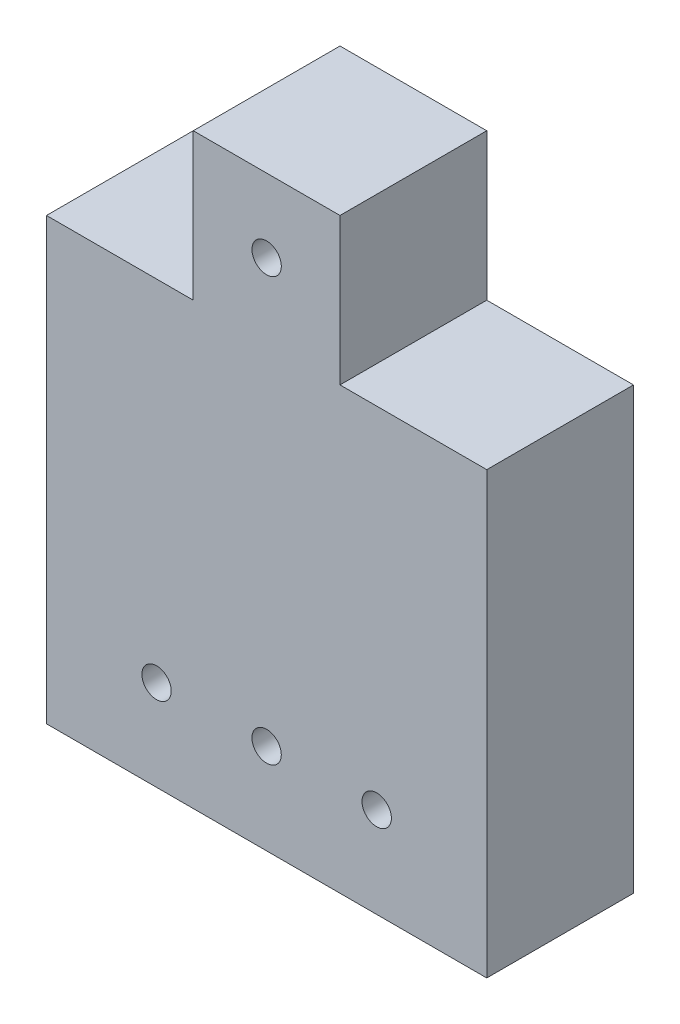
ISO-10303-21;
HEADER;
FILE_DESCRIPTION(('STEP AP214'),'2;1');
FILE_NAME('part.step','',(''),(''),'','','');
FILE_SCHEMA(('AUTOMOTIVE_DESIGN { 1 0 10303 214 1 1 1 1 }'));
ENDSEC;
DATA;
#1=APPLICATION_CONTEXT('core data for automotive mechanical design processes');
#2=APPLICATION_PROTOCOL_DEFINITION('international standard','automotive_design',2000,#1);
#3=PRODUCT_CONTEXT('',#1,'mechanical');
#4=PRODUCT('Part','Part','',(#3));
#5=PRODUCT_RELATED_PRODUCT_CATEGORY('part','',(#4));
#6=PRODUCT_DEFINITION_FORMATION('','',#4);
#7=PRODUCT_DEFINITION_CONTEXT('part definition',#1,'design');
#8=PRODUCT_DEFINITION('design','',#6,#7);
#9=PRODUCT_DEFINITION_SHAPE('','',#8);
#10=(LENGTH_UNIT() NAMED_UNIT(*) SI_UNIT(.MILLI.,.METRE.));
#11=(NAMED_UNIT(*) PLANE_ANGLE_UNIT() SI_UNIT($,.RADIAN.));
#12=(NAMED_UNIT(*) SI_UNIT($,.STERADIAN.) SOLID_ANGLE_UNIT());
#13=UNCERTAINTY_MEASURE_WITH_UNIT(LENGTH_MEASURE(1.E-05),#10,'distance_accuracy_value','');
#14=(GEOMETRIC_REPRESENTATION_CONTEXT(3) GLOBAL_UNCERTAINTY_ASSIGNED_CONTEXT((#13)) GLOBAL_UNIT_ASSIGNED_CONTEXT((#10,
#11,#12)) REPRESENTATION_CONTEXT('',''));
#15=CARTESIAN_POINT('',(0.,0.,0.));
#16=DIRECTION('',(0.,0.,1.));
#17=DIRECTION('',(1.,0.,0.));
#18=AXIS2_PLACEMENT_3D('',#15,#16,#17);
#19=CARTESIAN_POINT('',(0.,0.,6.35));
#20=DIRECTION('',(1.,0.,0.));
#21=DIRECTION('',(0.,1.,0.));
#22=AXIS2_PLACEMENT_3D('',#19,#20,#21);
#23=PLANE('',#22);
#24=DIRECTION('',(0.,-1.,0.));
#25=VECTOR('',#24,1.);
#26=CARTESIAN_POINT('',(0.,0.,6.35));
#27=LINE('',#26,#25);
#28=CARTESIAN_POINT('',(0.,19.05,6.35));
#29=VERTEX_POINT('',#28);
#30=CARTESIAN_POINT('',(0.,0.,6.35));
#31=VERTEX_POINT('',#30);
#32=EDGE_CURVE('E126',#29,#31,#27,.T.);
#33=ORIENTED_EDGE('',*,*,#32,.F.);
#34=DIRECTION('',(0.,0.,-1.));
#35=VECTOR('',#34,1.);
#36=CARTESIAN_POINT('',(0.,19.05,6.35));
#37=LINE('',#36,#35);
#38=CARTESIAN_POINT('',(0.,19.05,0.));
#39=VERTEX_POINT('',#38);
#40=EDGE_CURVE('E133',#29,#39,#37,.T.);
#41=ORIENTED_EDGE('',*,*,#40,.T.);
#42=DIRECTION('',(0.,-1.,0.));
#43=VECTOR('',#42,1.);
#44=CARTESIAN_POINT('',(0.,0.,0.));
#45=LINE('',#44,#43);
#46=CARTESIAN_POINT('',(0.,0.,0.));
#47=VERTEX_POINT('',#46);
#48=EDGE_CURVE('E130',#39,#47,#45,.T.);
#49=ORIENTED_EDGE('',*,*,#48,.T.);
#50=DIRECTION('',(0.,0.,-1.));
#51=VECTOR('',#50,1.);
#52=CARTESIAN_POINT('',(0.,0.,6.35));
#53=LINE('',#52,#51);
#54=EDGE_CURVE('E11',#31,#47,#53,.T.);
#55=ORIENTED_EDGE('',*,*,#54,.F.);
#56=EDGE_LOOP('',(#33,#41,#49,#55));
#57=FACE_BOUND('',#56,.T.);
#58=ADVANCED_FACE('F35',(#57),#23,.F.);
#59=CARTESIAN_POINT('',(0.,0.,6.35));
#60=DIRECTION('',(0.,1.,0.));
#61=DIRECTION('',(0.,0.,1.));
#62=AXIS2_PLACEMENT_3D('',#59,#60,#61);
#63=PLANE('',#62);
#64=DIRECTION('',(1.,0.,0.));
#65=VECTOR('',#64,1.);
#66=CARTESIAN_POINT('',(0.,0.,0.));
#67=LINE('',#66,#65);
#68=CARTESIAN_POINT('',(19.05,0.,0.));
#69=VERTEX_POINT('',#68);
#70=EDGE_CURVE('E132',#47,#69,#67,.T.);
#71=ORIENTED_EDGE('',*,*,#70,.T.);
#72=DIRECTION('',(0.,0.,-1.));
#73=VECTOR('',#72,1.);
#74=CARTESIAN_POINT('',(19.05,0.,6.35));
#75=LINE('',#74,#73);
#76=CARTESIAN_POINT('',(19.05,0.,6.35));
#77=VERTEX_POINT('',#76);
#78=EDGE_CURVE('E42',#77,#69,#75,.T.);
#79=ORIENTED_EDGE('',*,*,#78,.F.);
#80=DIRECTION('',(1.,0.,0.));
#81=VECTOR('',#80,1.);
#82=CARTESIAN_POINT('',(0.,0.,6.35));
#83=LINE('',#82,#81);
#84=EDGE_CURVE('E121',#31,#77,#83,.T.);
#85=ORIENTED_EDGE('',*,*,#84,.F.);
#86=ORIENTED_EDGE('',*,*,#54,.T.);
#87=EDGE_LOOP('',(#71,#79,#85,#86));
#88=FACE_BOUND('',#87,.T.);
#89=ADVANCED_FACE('F174',(#88),#63,.F.);
#90=CARTESIAN_POINT('',(19.05,0.,6.35));
#91=DIRECTION('',(-1.,0.,0.));
#92=DIRECTION('',(0.,-1.,0.));
#93=AXIS2_PLACEMENT_3D('',#90,#91,#92);
#94=PLANE('',#93);
#95=DIRECTION('',(0.,1.,0.));
#96=VECTOR('',#95,1.);
#97=CARTESIAN_POINT('',(19.05,0.,0.));
#98=LINE('',#97,#96);
#99=CARTESIAN_POINT('',(19.05,19.05,0.));
#100=VERTEX_POINT('',#99);
#101=EDGE_CURVE('E117',#69,#100,#98,.T.);
#102=ORIENTED_EDGE('',*,*,#101,.T.);
#103=DIRECTION('',(0.,0.,-1.));
#104=VECTOR('',#103,1.);
#105=CARTESIAN_POINT('',(19.05,19.05,6.35));
#106=LINE('',#105,#104);
#107=CARTESIAN_POINT('',(19.05,19.05,6.35));
#108=VERTEX_POINT('',#107);
#109=EDGE_CURVE('E49',#108,#100,#106,.T.);
#110=ORIENTED_EDGE('',*,*,#109,.F.);
#111=DIRECTION('',(0.,1.,0.));
#112=VECTOR('',#111,1.);
#113=CARTESIAN_POINT('',(19.05,0.,6.35));
#114=LINE('',#113,#112);
#115=EDGE_CURVE('E115',#77,#108,#114,.T.);
#116=ORIENTED_EDGE('',*,*,#115,.F.);
#117=ORIENTED_EDGE('',*,*,#78,.T.);
#118=EDGE_LOOP('',(#102,#110,#116,#117));
#119=FACE_BOUND('',#118,.T.);
#120=ADVANCED_FACE('F113',(#119),#94,.F.);
#121=CARTESIAN_POINT('',(0.,25.4,6.35));
#122=DIRECTION('',(0.,-1.,0.));
#123=DIRECTION('',(0.,0.,-1.));
#124=AXIS2_PLACEMENT_3D('',#121,#122,#123);
#125=PLANE('',#124);
#126=DIRECTION('',(-1.,0.,0.));
#127=VECTOR('',#126,1.);
#128=CARTESIAN_POINT('',(0.,25.4,6.35));
#129=LINE('',#128,#127);
#130=CARTESIAN_POINT('',(12.7,25.4,6.35));
#131=VERTEX_POINT('',#130);
#132=CARTESIAN_POINT('',(6.35,25.4,6.35));
#133=VERTEX_POINT('',#132);
#134=EDGE_CURVE('E123',#131,#133,#129,.T.);
#135=ORIENTED_EDGE('',*,*,#134,.F.);
#136=DIRECTION('',(0.,0.,-1.));
#137=VECTOR('',#136,1.);
#138=CARTESIAN_POINT('',(12.7,25.4,6.35));
#139=LINE('',#138,#137);
#140=CARTESIAN_POINT('',(12.7,25.4,0.));
#141=VERTEX_POINT('',#140);
#142=EDGE_CURVE('E151',#131,#141,#139,.T.);
#143=ORIENTED_EDGE('',*,*,#142,.T.);
#144=DIRECTION('',(-1.,0.,0.));
#145=VECTOR('',#144,1.);
#146=CARTESIAN_POINT('',(0.,25.4,0.));
#147=LINE('',#146,#145);
#148=CARTESIAN_POINT('',(6.35,25.4,0.));
#149=VERTEX_POINT('',#148);
#150=EDGE_CURVE('E57',#141,#149,#147,.T.);
#151=ORIENTED_EDGE('',*,*,#150,.T.);
#152=DIRECTION('',(0.,0.,-1.));
#153=VECTOR('',#152,1.);
#154=CARTESIAN_POINT('',(6.35,25.4,6.35));
#155=LINE('',#154,#153);
#156=EDGE_CURVE('E162',#133,#149,#155,.T.);
#157=ORIENTED_EDGE('',*,*,#156,.F.);
#158=EDGE_LOOP('',(#135,#143,#151,#157));
#159=FACE_BOUND('',#158,.T.);
#160=ADVANCED_FACE('F183',(#159),#125,.F.);
#161=CARTESIAN_POINT('',(0.,0.,6.35));
#162=DIRECTION('',(0.,0.,-1.));
#163=DIRECTION('',(-1.,0.,0.));
#164=AXIS2_PLACEMENT_3D('',#161,#162,#163);
#165=PLANE('',#164);
#166=CARTESIAN_POINT('',(4.7625,3.92205002782475,6.35));
#167=DIRECTION('',(0.,0.,1.));
#168=DIRECTION('',(1.,0.,0.));
#169=AXIS2_PLACEMENT_3D('',#166,#167,#168);
#170=CIRCLE('',#169,0.635000000000001);
#171=CARTESIAN_POINT('',(5.3975,3.92205002782475,6.35));
#172=VERTEX_POINT('',#171);
#173=EDGE_CURVE('E299',#172,#172,#170,.T.);
#174=ORIENTED_EDGE('',*,*,#173,.F.);
#175=EDGE_LOOP('',(#174));
#176=FACE_BOUND('',#175,.T.);
#177=CARTESIAN_POINT('',(9.525,3.92205002782475,6.35));
#178=DIRECTION('',(0.,0.,1.));
#179=DIRECTION('',(1.,0.,0.));
#180=AXIS2_PLACEMENT_3D('',#177,#178,#179);
#181=CIRCLE('',#180,0.635000000000001);
#182=CARTESIAN_POINT('',(10.16,3.92205002782475,6.35));
#183=VERTEX_POINT('',#182);
#184=EDGE_CURVE('E301',#183,#183,#181,.T.);
#185=ORIENTED_EDGE('',*,*,#184,.F.);
#186=EDGE_LOOP('',(#185));
#187=FACE_BOUND('',#186,.T.);
#188=CARTESIAN_POINT('',(14.2875,3.92205002782475,6.35));
#189=DIRECTION('',(0.,0.,1.));
#190=DIRECTION('',(1.,0.,0.));
#191=AXIS2_PLACEMENT_3D('',#188,#189,#190);
#192=CIRCLE('',#191,0.634999999999999);
#193=CARTESIAN_POINT('',(14.9225,3.92205002782475,6.35));
#194=VERTEX_POINT('',#193);
#195=EDGE_CURVE('E307',#194,#194,#192,.T.);
#196=ORIENTED_EDGE('',*,*,#195,.F.);
#197=EDGE_LOOP('',(#196));
#198=FACE_BOUND('',#197,.T.);
#199=CARTESIAN_POINT('',(9.52500000000001,22.225,6.35));
#200=DIRECTION('',(0.,0.,-1.));
#201=DIRECTION('',(-1.,0.,0.));
#202=AXIS2_PLACEMENT_3D('',#199,#200,#201);
#203=CIRCLE('',#202,0.635);
#204=CARTESIAN_POINT('',(8.89000000000001,22.225,6.35));
#205=VERTEX_POINT('',#204);
#206=EDGE_CURVE('E143',#205,#205,#203,.T.);
#207=ORIENTED_EDGE('',*,*,#206,.T.);
#208=EDGE_LOOP('',(#207));
#209=FACE_BOUND('',#208,.T.);
#210=DIRECTION('',(-1.,0.,0.));
#211=VECTOR('',#210,1.);
#212=CARTESIAN_POINT('',(19.05,19.05,6.35));
#213=LINE('',#212,#211);
#214=CARTESIAN_POINT('',(12.7,19.05,6.35));
#215=VERTEX_POINT('',#214);
#216=EDGE_CURVE('E100',#108,#215,#213,.T.);
#217=ORIENTED_EDGE('',*,*,#216,.T.);
#218=DIRECTION('',(0.,1.,0.));
#219=VECTOR('',#218,1.);
#220=CARTESIAN_POINT('',(12.7,25.4,6.35));
#221=LINE('',#220,#219);
#222=EDGE_CURVE('E107',#215,#131,#221,.T.);
#223=ORIENTED_EDGE('',*,*,#222,.T.);
#224=ORIENTED_EDGE('',*,*,#134,.T.);
#225=DIRECTION('',(0.,-1.,0.));
#226=VECTOR('',#225,1.);
#227=CARTESIAN_POINT('',(6.35,25.4,6.35));
#228=LINE('',#227,#226);
#229=CARTESIAN_POINT('',(6.35,19.05,6.35));
#230=VERTEX_POINT('',#229);
#231=EDGE_CURVE('E155',#133,#230,#228,.T.);
#232=ORIENTED_EDGE('',*,*,#231,.T.);
#233=DIRECTION('',(-1.,0.,0.));
#234=VECTOR('',#233,1.);
#235=CARTESIAN_POINT('',(0.,19.05,6.35));
#236=LINE('',#235,#234);
#237=EDGE_CURVE('E158',#230,#29,#236,.T.);
#238=ORIENTED_EDGE('',*,*,#237,.T.);
#239=ORIENTED_EDGE('',*,*,#32,.T.);
#240=ORIENTED_EDGE('',*,*,#84,.T.);
#241=ORIENTED_EDGE('',*,*,#115,.T.);
#242=EDGE_LOOP('',(#217,#223,#224,#232,#238,#239,#240,#241));
#243=FACE_BOUND('',#242,.T.);
#244=ADVANCED_FACE('F119',(#176,#187,#198,#209,#243),#165,.F.);
#245=CARTESIAN_POINT('',(0.,0.,0.));
#246=DIRECTION('',(0.,0.,-1.));
#247=DIRECTION('',(-1.,0.,0.));
#248=AXIS2_PLACEMENT_3D('',#245,#246,#247);
#249=PLANE('',#248);
#250=CARTESIAN_POINT('',(4.7625,3.92205002782475,0.));
#251=DIRECTION('',(0.,0.,1.));
#252=DIRECTION('',(1.,0.,0.));
#253=AXIS2_PLACEMENT_3D('',#250,#251,#252);
#254=CIRCLE('',#253,0.635000000000001);
#255=CARTESIAN_POINT('',(5.3975,3.92205002782475,0.));
#256=VERTEX_POINT('',#255);
#257=EDGE_CURVE('E296',#256,#256,#254,.T.);
#258=ORIENTED_EDGE('',*,*,#257,.T.);
#259=EDGE_LOOP('',(#258));
#260=FACE_BOUND('',#259,.T.);
#261=CARTESIAN_POINT('',(9.525,3.92205002782475,0.));
#262=DIRECTION('',(0.,0.,1.));
#263=DIRECTION('',(1.,0.,0.));
#264=AXIS2_PLACEMENT_3D('',#261,#262,#263);
#265=CIRCLE('',#264,0.635000000000001);
#266=CARTESIAN_POINT('',(10.16,3.92205002782475,0.));
#267=VERTEX_POINT('',#266);
#268=EDGE_CURVE('E304',#267,#267,#265,.T.);
#269=ORIENTED_EDGE('',*,*,#268,.T.);
#270=EDGE_LOOP('',(#269));
#271=FACE_BOUND('',#270,.T.);
#272=CARTESIAN_POINT('',(14.2875,3.92205002782475,0.));
#273=DIRECTION('',(0.,0.,1.));
#274=DIRECTION('',(1.,0.,0.));
#275=AXIS2_PLACEMENT_3D('',#272,#273,#274);
#276=CIRCLE('',#275,0.634999999999999);
#277=CARTESIAN_POINT('',(14.9225,3.92205002782475,0.));
#278=VERTEX_POINT('',#277);
#279=EDGE_CURVE('E310',#278,#278,#276,.T.);
#280=ORIENTED_EDGE('',*,*,#279,.T.);
#281=EDGE_LOOP('',(#280));
#282=FACE_BOUND('',#281,.T.);
#283=CARTESIAN_POINT('',(9.52500000000001,22.225,0.));
#284=DIRECTION('',(0.,0.,-1.));
#285=DIRECTION('',(-1.,0.,0.));
#286=AXIS2_PLACEMENT_3D('',#283,#284,#285);
#287=CIRCLE('',#286,0.635);
#288=CARTESIAN_POINT('',(8.89000000000001,22.225,0.));
#289=VERTEX_POINT('',#288);
#290=EDGE_CURVE('E147',#289,#289,#287,.T.);
#291=ORIENTED_EDGE('',*,*,#290,.F.);
#292=EDGE_LOOP('',(#291));
#293=FACE_BOUND('',#292,.T.);
#294=DIRECTION('',(0.,1.,0.));
#295=VECTOR('',#294,1.);
#296=CARTESIAN_POINT('',(12.7,25.4,0.));
#297=LINE('',#296,#295);
#298=CARTESIAN_POINT('',(12.7,19.05,0.));
#299=VERTEX_POINT('',#298);
#300=EDGE_CURVE('E108',#299,#141,#297,.T.);
#301=ORIENTED_EDGE('',*,*,#300,.F.);
#302=DIRECTION('',(-1.,0.,0.));
#303=VECTOR('',#302,1.);
#304=CARTESIAN_POINT('',(19.05,19.05,0.));
#305=LINE('',#304,#303);
#306=EDGE_CURVE('E142',#100,#299,#305,.T.);
#307=ORIENTED_EDGE('',*,*,#306,.F.);
#308=ORIENTED_EDGE('',*,*,#101,.F.);
#309=ORIENTED_EDGE('',*,*,#70,.F.);
#310=ORIENTED_EDGE('',*,*,#48,.F.);
#311=DIRECTION('',(-1.,0.,0.));
#312=VECTOR('',#311,1.);
#313=CARTESIAN_POINT('',(0.,19.05,0.));
#314=LINE('',#313,#312);
#315=CARTESIAN_POINT('',(6.35,19.05,0.));
#316=VERTEX_POINT('',#315);
#317=EDGE_CURVE('E159',#316,#39,#314,.T.);
#318=ORIENTED_EDGE('',*,*,#317,.F.);
#319=DIRECTION('',(0.,-1.,0.));
#320=VECTOR('',#319,1.);
#321=CARTESIAN_POINT('',(6.35,25.4,0.));
#322=LINE('',#321,#320);
#323=EDGE_CURVE('E153',#149,#316,#322,.T.);
#324=ORIENTED_EDGE('',*,*,#323,.F.);
#325=ORIENTED_EDGE('',*,*,#150,.F.);
#326=EDGE_LOOP('',(#301,#307,#308,#309,#310,#318,#324,#325));
#327=FACE_BOUND('',#326,.T.);
#328=ADVANCED_FACE('F140',(#260,#271,#282,#293,#327),#249,.T.);
#329=CARTESIAN_POINT('',(0.,19.05,6.35));
#330=DIRECTION('',(0.,-1.,0.));
#331=DIRECTION('',(0.,0.,-1.));
#332=AXIS2_PLACEMENT_3D('',#329,#330,#331);
#333=PLANE('',#332);
#334=ORIENTED_EDGE('',*,*,#317,.T.);
#335=ORIENTED_EDGE('',*,*,#40,.F.);
#336=ORIENTED_EDGE('',*,*,#237,.F.);
#337=DIRECTION('',(0.,0.,-1.));
#338=VECTOR('',#337,1.);
#339=CARTESIAN_POINT('',(6.35,19.05,6.35));
#340=LINE('',#339,#338);
#341=EDGE_CURVE('E168',#230,#316,#340,.T.);
#342=ORIENTED_EDGE('',*,*,#341,.T.);
#343=EDGE_LOOP('',(#334,#335,#336,#342));
#344=FACE_BOUND('',#343,.T.);
#345=ADVANCED_FACE('F178',(#344),#333,.F.);
#346=CARTESIAN_POINT('',(6.35,25.4,6.35));
#347=DIRECTION('',(1.,0.,0.));
#348=DIRECTION('',(0.,1.,0.));
#349=AXIS2_PLACEMENT_3D('',#346,#347,#348);
#350=PLANE('',#349);
#351=ORIENTED_EDGE('',*,*,#323,.T.);
#352=ORIENTED_EDGE('',*,*,#341,.F.);
#353=ORIENTED_EDGE('',*,*,#231,.F.);
#354=ORIENTED_EDGE('',*,*,#156,.T.);
#355=EDGE_LOOP('',(#351,#352,#353,#354));
#356=FACE_BOUND('',#355,.T.);
#357=ADVANCED_FACE('F181',(#356),#350,.F.);
#358=CARTESIAN_POINT('',(12.7,25.4,6.35));
#359=DIRECTION('',(-1.,0.,0.));
#360=DIRECTION('',(0.,-1.,0.));
#361=AXIS2_PLACEMENT_3D('',#358,#359,#360);
#362=PLANE('',#361);
#363=ORIENTED_EDGE('',*,*,#300,.T.);
#364=ORIENTED_EDGE('',*,*,#142,.F.);
#365=ORIENTED_EDGE('',*,*,#222,.F.);
#366=DIRECTION('',(0.,0.,-1.));
#367=VECTOR('',#366,1.);
#368=CARTESIAN_POINT('',(12.7,19.05,6.35));
#369=LINE('',#368,#367);
#370=EDGE_CURVE('E102',#215,#299,#369,.T.);
#371=ORIENTED_EDGE('',*,*,#370,.T.);
#372=EDGE_LOOP('',(#363,#364,#365,#371));
#373=FACE_BOUND('',#372,.T.);
#374=ADVANCED_FACE('F185',(#373),#362,.F.);
#375=CARTESIAN_POINT('',(19.05,19.05,6.35));
#376=DIRECTION('',(0.,-1.,0.));
#377=DIRECTION('',(0.,0.,-1.));
#378=AXIS2_PLACEMENT_3D('',#375,#376,#377);
#379=PLANE('',#378);
#380=ORIENTED_EDGE('',*,*,#306,.T.);
#381=ORIENTED_EDGE('',*,*,#370,.F.);
#382=ORIENTED_EDGE('',*,*,#216,.F.);
#383=ORIENTED_EDGE('',*,*,#109,.T.);
#384=EDGE_LOOP('',(#380,#381,#382,#383));
#385=FACE_BOUND('',#384,.T.);
#386=ADVANCED_FACE('F101',(#385),#379,.F.);
#387=CARTESIAN_POINT('',(9.52500000000001,22.225,6.35));
#388=DIRECTION('',(0.,0.,-1.));
#389=DIRECTION('',(-1.,0.,0.));
#390=AXIS2_PLACEMENT_3D('',#387,#388,#389);
#391=CYLINDRICAL_SURFACE('',#390,0.635);
#392=ORIENTED_EDGE('',*,*,#206,.F.);
#393=EDGE_LOOP('',(#392));
#394=FACE_BOUND('',#393,.T.);
#395=ORIENTED_EDGE('',*,*,#290,.T.);
#396=EDGE_LOOP('',(#395));
#397=FACE_BOUND('',#396,.T.);
#398=ADVANCED_FACE('F192',(#394,#397),#391,.F.);
#399=CARTESIAN_POINT('',(14.2875,3.92205002782475,0.));
#400=DIRECTION('',(0.,0.,1.));
#401=DIRECTION('',(1.,0.,0.));
#402=AXIS2_PLACEMENT_3D('',#399,#400,#401);
#403=CYLINDRICAL_SURFACE('',#402,0.634999999999999);
#404=ORIENTED_EDGE('',*,*,#279,.F.);
#405=EDGE_LOOP('',(#404));
#406=FACE_BOUND('',#405,.T.);
#407=ORIENTED_EDGE('',*,*,#195,.T.);
#408=EDGE_LOOP('',(#407));
#409=FACE_BOUND('',#408,.T.);
#410=ADVANCED_FACE('F256',(#406,#409),#403,.F.);
#411=CARTESIAN_POINT('',(9.525,3.92205002782475,0.));
#412=DIRECTION('',(0.,0.,1.));
#413=DIRECTION('',(1.,0.,0.));
#414=AXIS2_PLACEMENT_3D('',#411,#412,#413);
#415=CYLINDRICAL_SURFACE('',#414,0.635000000000001);
#416=ORIENTED_EDGE('',*,*,#268,.F.);
#417=EDGE_LOOP('',(#416));
#418=FACE_BOUND('',#417,.T.);
#419=ORIENTED_EDGE('',*,*,#184,.T.);
#420=EDGE_LOOP('',(#419));
#421=FACE_BOUND('',#420,.T.);
#422=ADVANCED_FACE('F269',(#418,#421),#415,.F.);
#423=CARTESIAN_POINT('',(4.7625,3.92205002782475,0.));
#424=DIRECTION('',(0.,0.,1.));
#425=DIRECTION('',(1.,0.,0.));
#426=AXIS2_PLACEMENT_3D('',#423,#424,#425);
#427=CYLINDRICAL_SURFACE('',#426,0.635000000000001);
#428=ORIENTED_EDGE('',*,*,#257,.F.);
#429=EDGE_LOOP('',(#428));
#430=FACE_BOUND('',#429,.T.);
#431=ORIENTED_EDGE('',*,*,#173,.T.);
#432=EDGE_LOOP('',(#431));
#433=FACE_BOUND('',#432,.T.);
#434=ADVANCED_FACE('F279',(#430,#433),#427,.F.);
#435=CLOSED_SHELL('',(#58,#89,#120,#160,#244,#328,#345,#357,#374,#386,#398,#410,#422,#434));
#436=MANIFOLD_SOLID_BREP('B2',#435);
#437=ADVANCED_BREP_SHAPE_REPRESENTATION('',(#18,#436),#14);
#438=SHAPE_DEFINITION_REPRESENTATION(#9,#437);
ENDSEC;
END-ISO-10303-21;
